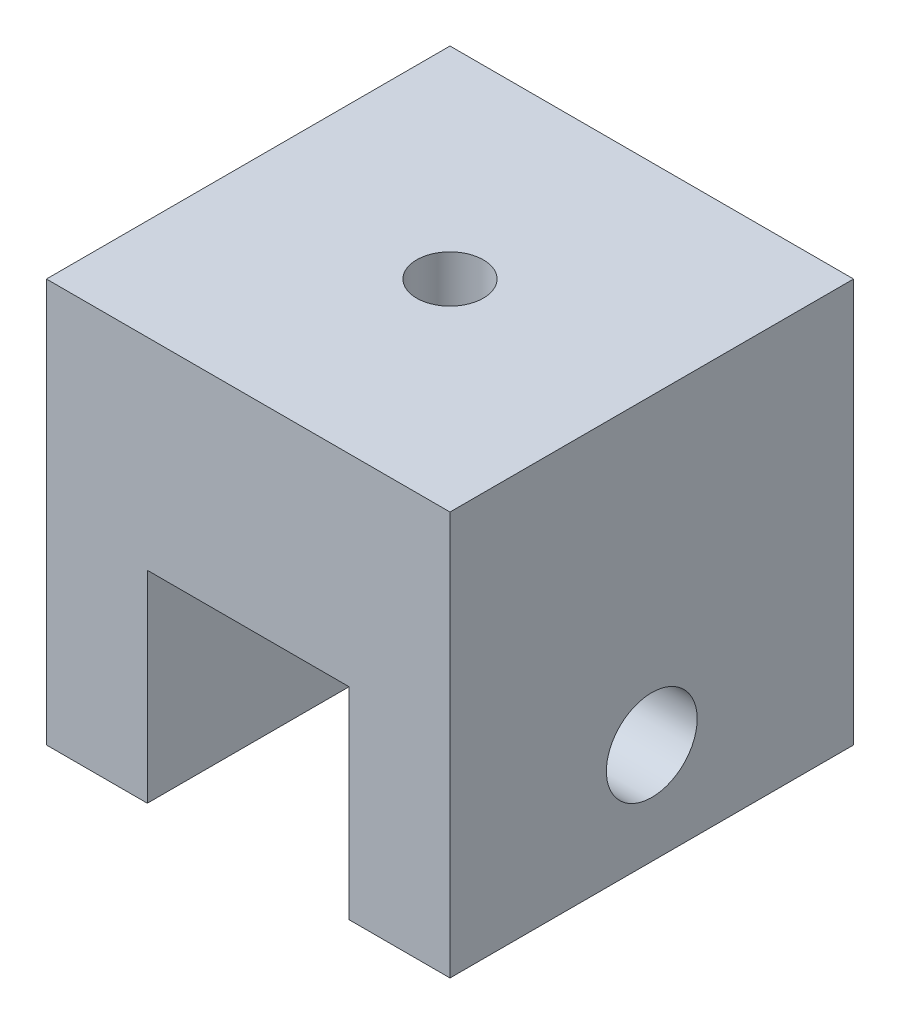
ISO-10303-21;
HEADER;
FILE_DESCRIPTION(('STEP AP214'),'2;1');
FILE_NAME('part.step','',(''),(''),'','','');
FILE_SCHEMA(('AUTOMOTIVE_DESIGN { 1 0 10303 214 1 1 1 1 }'));
ENDSEC;
DATA;
#1=APPLICATION_CONTEXT('core data for automotive mechanical design processes');
#2=APPLICATION_PROTOCOL_DEFINITION('international standard','automotive_design',2000,#1);
#3=PRODUCT_CONTEXT('',#1,'mechanical');
#4=PRODUCT('Part','Part','',(#3));
#5=PRODUCT_RELATED_PRODUCT_CATEGORY('part','',(#4));
#6=PRODUCT_DEFINITION_FORMATION('','',#4);
#7=PRODUCT_DEFINITION_CONTEXT('part definition',#1,'design');
#8=PRODUCT_DEFINITION('design','',#6,#7);
#9=PRODUCT_DEFINITION_SHAPE('','',#8);
#10=(LENGTH_UNIT() NAMED_UNIT(*) SI_UNIT(.MILLI.,.METRE.));
#11=(NAMED_UNIT(*) PLANE_ANGLE_UNIT() SI_UNIT($,.RADIAN.));
#12=(NAMED_UNIT(*) SI_UNIT($,.STERADIAN.) SOLID_ANGLE_UNIT());
#13=UNCERTAINTY_MEASURE_WITH_UNIT(LENGTH_MEASURE(1.E-05),#10,'distance_accuracy_value','');
#14=(GEOMETRIC_REPRESENTATION_CONTEXT(3) GLOBAL_UNCERTAINTY_ASSIGNED_CONTEXT((#13)) GLOBAL_UNIT_ASSIGNED_CONTEXT((#10,
#11,#12)) REPRESENTATION_CONTEXT('',''));
#15=CARTESIAN_POINT('',(0.,0.,0.));
#16=DIRECTION('',(0.,0.,1.));
#17=DIRECTION('',(1.,0.,0.));
#18=AXIS2_PLACEMENT_3D('',#15,#16,#17);
#19=CARTESIAN_POINT('',(0.,0.,0.));
#20=DIRECTION('',(0.,-1.,0.));
#21=DIRECTION('',(0.,0.,-1.));
#22=AXIS2_PLACEMENT_3D('',#19,#20,#21);
#23=PLANE('',#22);
#24=DIRECTION('',(0.,0.,1.));
#25=VECTOR('',#24,1.);
#26=CARTESIAN_POINT('',(10.,0.,0.));
#27=LINE('',#26,#25);
#28=CARTESIAN_POINT('',(10.,0.,-20.));
#29=VERTEX_POINT('',#28);
#30=CARTESIAN_POINT('',(10.,0.,20.));
#31=VERTEX_POINT('',#30);
#32=EDGE_CURVE('E11',#29,#31,#27,.T.);
#33=ORIENTED_EDGE('',*,*,#32,.F.);
#34=DIRECTION('',(-1.,0.,0.));
#35=VECTOR('',#34,1.);
#36=CARTESIAN_POINT('',(-20.,0.,-20.));
#37=LINE('',#36,#35);
#38=CARTESIAN_POINT('',(20.,0.,-20.));
#39=VERTEX_POINT('',#38);
#40=EDGE_CURVE('E138',#39,#29,#37,.T.);
#41=ORIENTED_EDGE('',*,*,#40,.F.);
#42=DIRECTION('',(0.,0.,-1.));
#43=VECTOR('',#42,1.);
#44=CARTESIAN_POINT('',(20.,0.,20.));
#45=LINE('',#44,#43);
#46=CARTESIAN_POINT('',(20.,0.,20.));
#47=VERTEX_POINT('',#46);
#48=EDGE_CURVE('E161',#47,#39,#45,.T.);
#49=ORIENTED_EDGE('',*,*,#48,.F.);
#50=DIRECTION('',(1.,0.,0.));
#51=VECTOR('',#50,1.);
#52=CARTESIAN_POINT('',(-20.,0.,20.));
#53=LINE('',#52,#51);
#54=EDGE_CURVE('E86',#31,#47,#53,.T.);
#55=ORIENTED_EDGE('',*,*,#54,.F.);
#56=EDGE_LOOP('',(#33,#41,#49,#55));
#57=FACE_BOUND('',#56,.T.);
#58=ADVANCED_FACE('F39',(#57),#23,.T.);
#59=CARTESIAN_POINT('',(20.,40.,20.));
#60=DIRECTION('',(-1.,0.,0.));
#61=DIRECTION('',(0.,0.,1.));
#62=AXIS2_PLACEMENT_3D('',#59,#60,#61);
#63=PLANE('',#62);
#64=CARTESIAN_POINT('',(20.,10.,0.));
#65=DIRECTION('',(1.,0.,0.));
#66=DIRECTION('',(0.,0.,-1.));
#67=AXIS2_PLACEMENT_3D('',#64,#65,#66);
#68=CIRCLE('',#67,4.5);
#69=CARTESIAN_POINT('',(20.,10.,-4.5));
#70=VERTEX_POINT('',#69);
#71=EDGE_CURVE('E331',#70,#70,#68,.T.);
#72=ORIENTED_EDGE('',*,*,#71,.F.);
#73=EDGE_LOOP('',(#72));
#74=FACE_BOUND('',#73,.T.);
#75=ORIENTED_EDGE('',*,*,#48,.T.);
#76=DIRECTION('',(0.,-1.,0.));
#77=VECTOR('',#76,1.);
#78=CARTESIAN_POINT('',(20.,40.,-20.));
#79=LINE('',#78,#77);
#80=CARTESIAN_POINT('',(20.,40.,-20.));
#81=VERTEX_POINT('',#80);
#82=EDGE_CURVE('E196',#81,#39,#79,.T.);
#83=ORIENTED_EDGE('',*,*,#82,.F.);
#84=DIRECTION('',(0.,0.,-1.));
#85=VECTOR('',#84,1.);
#86=CARTESIAN_POINT('',(20.,40.,20.));
#87=LINE('',#86,#85);
#88=CARTESIAN_POINT('',(20.,40.,20.));
#89=VERTEX_POINT('',#88);
#90=EDGE_CURVE('E162',#89,#81,#87,.T.);
#91=ORIENTED_EDGE('',*,*,#90,.F.);
#92=DIRECTION('',(0.,-1.,0.));
#93=VECTOR('',#92,1.);
#94=CARTESIAN_POINT('',(20.,40.,20.));
#95=LINE('',#94,#93);
#96=EDGE_CURVE('E173',#89,#47,#95,.T.);
#97=ORIENTED_EDGE('',*,*,#96,.T.);
#98=EDGE_LOOP('',(#75,#83,#91,#97));
#99=FACE_BOUND('',#98,.T.);
#100=ADVANCED_FACE('F41',(#74,#99),#63,.F.);
#101=CARTESIAN_POINT('',(-20.,40.,-20.));
#102=DIRECTION('',(0.,0.,1.));
#103=DIRECTION('',(1.,0.,0.));
#104=AXIS2_PLACEMENT_3D('',#101,#102,#103);
#105=PLANE('',#104);
#106=ORIENTED_EDGE('',*,*,#40,.T.);
#107=DIRECTION('',(0.,1.,0.));
#108=VECTOR('',#107,1.);
#109=CARTESIAN_POINT('',(10.,-20.,-20.));
#110=LINE('',#109,#108);
#111=CARTESIAN_POINT('',(10.,20.,-20.));
#112=VERTEX_POINT('',#111);
#113=EDGE_CURVE('E118',#29,#112,#110,.T.);
#114=ORIENTED_EDGE('',*,*,#113,.T.);
#115=DIRECTION('',(-1.,0.,0.));
#116=VECTOR('',#115,1.);
#117=CARTESIAN_POINT('',(-10.,20.,-20.));
#118=LINE('',#117,#116);
#119=CARTESIAN_POINT('',(-10.,20.,-20.));
#120=VERTEX_POINT('',#119);
#121=EDGE_CURVE('E129',#112,#120,#118,.T.);
#122=ORIENTED_EDGE('',*,*,#121,.T.);
#123=DIRECTION('',(0.,-1.,0.));
#124=VECTOR('',#123,1.);
#125=CARTESIAN_POINT('',(-10.,-20.,-20.));
#126=LINE('',#125,#124);
#127=CARTESIAN_POINT('',(-10.,0.,-20.));
#128=VERTEX_POINT('',#127);
#129=EDGE_CURVE('E126',#120,#128,#126,.T.);
#130=ORIENTED_EDGE('',*,*,#129,.T.);
#131=CARTESIAN_POINT('',(-20.,0.,-20.));
#132=VERTEX_POINT('',#131);
#133=EDGE_CURVE('E177',#128,#132,#37,.T.);
#134=ORIENTED_EDGE('',*,*,#133,.T.);
#135=DIRECTION('',(0.,-1.,0.));
#136=VECTOR('',#135,1.);
#137=CARTESIAN_POINT('',(-20.,40.,-20.));
#138=LINE('',#137,#136);
#139=CARTESIAN_POINT('',(-20.,40.,-20.));
#140=VERTEX_POINT('',#139);
#141=EDGE_CURVE('E192',#140,#132,#138,.T.);
#142=ORIENTED_EDGE('',*,*,#141,.F.);
#143=DIRECTION('',(-1.,0.,0.));
#144=VECTOR('',#143,1.);
#145=CARTESIAN_POINT('',(-20.,40.,-20.));
#146=LINE('',#145,#144);
#147=EDGE_CURVE('E94',#81,#140,#146,.T.);
#148=ORIENTED_EDGE('',*,*,#147,.F.);
#149=ORIENTED_EDGE('',*,*,#82,.T.);
#150=EDGE_LOOP('',(#106,#114,#122,#130,#134,#142,#148,#149));
#151=FACE_BOUND('',#150,.T.);
#152=ADVANCED_FACE('F137',(#151),#105,.F.);
#153=CARTESIAN_POINT('',(-20.,40.,20.));
#154=DIRECTION('',(1.,0.,0.));
#155=DIRECTION('',(0.,0.,-1.));
#156=AXIS2_PLACEMENT_3D('',#153,#154,#155);
#157=PLANE('',#156);
#158=CARTESIAN_POINT('',(-20.,10.,0.));
#159=DIRECTION('',(1.,0.,0.));
#160=DIRECTION('',(0.,0.,-1.));
#161=AXIS2_PLACEMENT_3D('',#158,#159,#160);
#162=CIRCLE('',#161,4.5);
#163=CARTESIAN_POINT('',(-20.,10.,-4.5));
#164=VERTEX_POINT('',#163);
#165=EDGE_CURVE('E337',#164,#164,#162,.T.);
#166=ORIENTED_EDGE('',*,*,#165,.T.);
#167=EDGE_LOOP('',(#166));
#168=FACE_BOUND('',#167,.T.);
#169=DIRECTION('',(0.,0.,1.));
#170=VECTOR('',#169,1.);
#171=CARTESIAN_POINT('',(-20.,0.,20.));
#172=LINE('',#171,#170);
#173=CARTESIAN_POINT('',(-20.,0.,20.));
#174=VERTEX_POINT('',#173);
#175=EDGE_CURVE('E180',#132,#174,#172,.T.);
#176=ORIENTED_EDGE('',*,*,#175,.T.);
#177=DIRECTION('',(0.,-1.,0.));
#178=VECTOR('',#177,1.);
#179=CARTESIAN_POINT('',(-20.,40.,20.));
#180=LINE('',#179,#178);
#181=CARTESIAN_POINT('',(-20.,40.,20.));
#182=VERTEX_POINT('',#181);
#183=EDGE_CURVE('E188',#182,#174,#180,.T.);
#184=ORIENTED_EDGE('',*,*,#183,.F.);
#185=DIRECTION('',(0.,0.,1.));
#186=VECTOR('',#185,1.);
#187=CARTESIAN_POINT('',(-20.,40.,20.));
#188=LINE('',#187,#186);
#189=EDGE_CURVE('E168',#140,#182,#188,.T.);
#190=ORIENTED_EDGE('',*,*,#189,.F.);
#191=ORIENTED_EDGE('',*,*,#141,.T.);
#192=EDGE_LOOP('',(#176,#184,#190,#191));
#193=FACE_BOUND('',#192,.T.);
#194=ADVANCED_FACE('F213',(#168,#193),#157,.F.);
#195=CARTESIAN_POINT('',(-20.,40.,20.));
#196=DIRECTION('',(0.,0.,-1.));
#197=DIRECTION('',(-1.,0.,0.));
#198=AXIS2_PLACEMENT_3D('',#195,#196,#197);
#199=PLANE('',#198);
#200=DIRECTION('',(-1.,0.,0.));
#201=VECTOR('',#200,1.);
#202=CARTESIAN_POINT('',(-10.,20.,20.));
#203=LINE('',#202,#201);
#204=CARTESIAN_POINT('',(10.,20.,20.));
#205=VERTEX_POINT('',#204);
#206=CARTESIAN_POINT('',(-10.,20.,20.));
#207=VERTEX_POINT('',#206);
#208=EDGE_CURVE('E142',#205,#207,#203,.T.);
#209=ORIENTED_EDGE('',*,*,#208,.F.);
#210=DIRECTION('',(0.,1.,0.));
#211=VECTOR('',#210,1.);
#212=CARTESIAN_POINT('',(10.,-20.,20.));
#213=LINE('',#212,#211);
#214=EDGE_CURVE('E120',#31,#205,#213,.T.);
#215=ORIENTED_EDGE('',*,*,#214,.F.);
#216=ORIENTED_EDGE('',*,*,#54,.T.);
#217=ORIENTED_EDGE('',*,*,#96,.F.);
#218=DIRECTION('',(1.,0.,0.));
#219=VECTOR('',#218,1.);
#220=CARTESIAN_POINT('',(-20.,40.,20.));
#221=LINE('',#220,#219);
#222=EDGE_CURVE('E65',#182,#89,#221,.T.);
#223=ORIENTED_EDGE('',*,*,#222,.F.);
#224=ORIENTED_EDGE('',*,*,#183,.T.);
#225=CARTESIAN_POINT('',(-10.,0.,20.));
#226=VERTEX_POINT('',#225);
#227=EDGE_CURVE('E165',#174,#226,#53,.T.);
#228=ORIENTED_EDGE('',*,*,#227,.T.);
#229=DIRECTION('',(0.,-1.,0.));
#230=VECTOR('',#229,1.);
#231=CARTESIAN_POINT('',(-10.,-20.,20.));
#232=LINE('',#231,#230);
#233=EDGE_CURVE('E56',#207,#226,#232,.T.);
#234=ORIENTED_EDGE('',*,*,#233,.F.);
#235=EDGE_LOOP('',(#209,#215,#216,#217,#223,#224,#228,#234));
#236=FACE_BOUND('',#235,.T.);
#237=ADVANCED_FACE('F215',(#236),#199,.F.);
#238=CARTESIAN_POINT('',(0.,40.,0.));
#239=DIRECTION('',(0.,-1.,0.));
#240=DIRECTION('',(0.,0.,-1.));
#241=AXIS2_PLACEMENT_3D('',#238,#239,#240);
#242=PLANE('',#241);
#243=CARTESIAN_POINT('',(0.,40.,0.));
#244=DIRECTION('',(0.,1.,0.));
#245=DIRECTION('',(0.,0.,1.));
#246=AXIS2_PLACEMENT_3D('',#243,#244,#245);
#247=CIRCLE('',#246,3.3);
#248=CARTESIAN_POINT('',(0.,40.,3.3));
#249=VERTEX_POINT('',#248);
#250=EDGE_CURVE('E157',#249,#249,#247,.T.);
#251=ORIENTED_EDGE('',*,*,#250,.F.);
#252=EDGE_LOOP('',(#251));
#253=FACE_BOUND('',#252,.T.);
#254=ORIENTED_EDGE('',*,*,#90,.T.);
#255=ORIENTED_EDGE('',*,*,#147,.T.);
#256=ORIENTED_EDGE('',*,*,#189,.T.);
#257=ORIENTED_EDGE('',*,*,#222,.T.);
#258=EDGE_LOOP('',(#254,#255,#256,#257));
#259=FACE_BOUND('',#258,.T.);
#260=ADVANCED_FACE('F220',(#253,#259),#242,.F.);
#261=DIRECTION('',(0.,0.,-1.));
#262=VECTOR('',#261,1.);
#263=CARTESIAN_POINT('',(-10.,0.,0.));
#264=LINE('',#263,#262);
#265=EDGE_CURVE('E49',#226,#128,#264,.T.);
#266=ORIENTED_EDGE('',*,*,#265,.F.);
#267=ORIENTED_EDGE('',*,*,#227,.F.);
#268=ORIENTED_EDGE('',*,*,#175,.F.);
#269=ORIENTED_EDGE('',*,*,#133,.F.);
#270=EDGE_LOOP('',(#266,#267,#268,#269));
#271=FACE_BOUND('',#270,.T.);
#272=ADVANCED_FACE('F208',(#271),#23,.T.);
#273=CARTESIAN_POINT('',(0.,0.,0.));
#274=DIRECTION('',(0.,1.,0.));
#275=DIRECTION('',(0.,0.,1.));
#276=AXIS2_PLACEMENT_3D('',#273,#274,#275);
#277=CYLINDRICAL_SURFACE('',#276,3.3);
#278=CARTESIAN_POINT('',(0.,20.,0.));
#279=DIRECTION('',(0.,1.,0.));
#280=DIRECTION('',(0.,0.,1.));
#281=AXIS2_PLACEMENT_3D('',#278,#279,#280);
#282=CIRCLE('',#281,3.3);
#283=CARTESIAN_POINT('',(0.,20.,3.3));
#284=VERTEX_POINT('',#283);
#285=EDGE_CURVE('E155',#284,#284,#282,.F.);
#286=ORIENTED_EDGE('',*,*,#285,.T.);
#287=EDGE_LOOP('',(#286));
#288=FACE_BOUND('',#287,.T.);
#289=ORIENTED_EDGE('',*,*,#250,.T.);
#290=EDGE_LOOP('',(#289));
#291=FACE_BOUND('',#290,.T.);
#292=ADVANCED_FACE('F228',(#288,#291),#277,.F.);
#293=CARTESIAN_POINT('',(-10.,20.,-20.));
#294=DIRECTION('',(0.,1.,0.));
#295=DIRECTION('',(0.,0.,1.));
#296=AXIS2_PLACEMENT_3D('',#293,#294,#295);
#297=PLANE('',#296);
#298=ORIENTED_EDGE('',*,*,#208,.T.);
#299=DIRECTION('',(0.,0.,1.));
#300=VECTOR('',#299,1.);
#301=CARTESIAN_POINT('',(-10.,20.,-20.));
#302=LINE('',#301,#300);
#303=EDGE_CURVE('E125',#120,#207,#302,.T.);
#304=ORIENTED_EDGE('',*,*,#303,.F.);
#305=ORIENTED_EDGE('',*,*,#121,.F.);
#306=DIRECTION('',(0.,0.,1.));
#307=VECTOR('',#306,1.);
#308=CARTESIAN_POINT('',(10.,20.,-20.));
#309=LINE('',#308,#307);
#310=EDGE_CURVE('E114',#112,#205,#309,.T.);
#311=ORIENTED_EDGE('',*,*,#310,.T.);
#312=EDGE_LOOP('',(#298,#304,#305,#311));
#313=FACE_BOUND('',#312,.T.);
#314=ORIENTED_EDGE('',*,*,#285,.F.);
#315=EDGE_LOOP('',(#314));
#316=FACE_BOUND('',#315,.T.);
#317=ADVANCED_FACE('F130',(#313,#316),#297,.F.);
#318=CARTESIAN_POINT('',(10.,-20.,-20.));
#319=DIRECTION('',(1.,0.,0.));
#320=DIRECTION('',(0.,0.,-1.));
#321=AXIS2_PLACEMENT_3D('',#318,#319,#320);
#322=PLANE('',#321);
#323=CARTESIAN_POINT('',(10.,10.,0.));
#324=DIRECTION('',(1.,0.,0.));
#325=DIRECTION('',(0.,0.,-1.));
#326=AXIS2_PLACEMENT_3D('',#323,#324,#325);
#327=CIRCLE('',#326,4.5);
#328=CARTESIAN_POINT('',(10.,10.,-4.5));
#329=VERTEX_POINT('',#328);
#330=EDGE_CURVE('E145',#329,#329,#327,.T.);
#331=ORIENTED_EDGE('',*,*,#330,.T.);
#332=EDGE_LOOP('',(#331));
#333=FACE_BOUND('',#332,.T.);
#334=ORIENTED_EDGE('',*,*,#32,.T.);
#335=ORIENTED_EDGE('',*,*,#214,.T.);
#336=ORIENTED_EDGE('',*,*,#310,.F.);
#337=ORIENTED_EDGE('',*,*,#113,.F.);
#338=EDGE_LOOP('',(#334,#335,#336,#337));
#339=FACE_BOUND('',#338,.T.);
#340=ADVANCED_FACE('F116',(#333,#339),#322,.F.);
#341=CARTESIAN_POINT('',(-10.,-20.,-20.));
#342=DIRECTION('',(-1.,0.,0.));
#343=DIRECTION('',(0.,0.,1.));
#344=AXIS2_PLACEMENT_3D('',#341,#342,#343);
#345=PLANE('',#344);
#346=CARTESIAN_POINT('',(-10.,10.,0.));
#347=DIRECTION('',(-1.,0.,0.));
#348=DIRECTION('',(0.,0.,1.));
#349=AXIS2_PLACEMENT_3D('',#346,#347,#348);
#350=CIRCLE('',#349,4.5);
#351=CARTESIAN_POINT('',(-10.,10.,4.5));
#352=VERTEX_POINT('',#351);
#353=EDGE_CURVE('E43',#352,#352,#350,.T.);
#354=ORIENTED_EDGE('',*,*,#353,.T.);
#355=EDGE_LOOP('',(#354));
#356=FACE_BOUND('',#355,.T.);
#357=ORIENTED_EDGE('',*,*,#265,.T.);
#358=ORIENTED_EDGE('',*,*,#129,.F.);
#359=ORIENTED_EDGE('',*,*,#303,.T.);
#360=ORIENTED_EDGE('',*,*,#233,.T.);
#361=EDGE_LOOP('',(#357,#358,#359,#360));
#362=FACE_BOUND('',#361,.T.);
#363=ADVANCED_FACE('F203',(#356,#362),#345,.F.);
#364=CARTESIAN_POINT('',(-20.,10.,0.));
#365=DIRECTION('',(1.,0.,0.));
#366=DIRECTION('',(0.,0.,-1.));
#367=AXIS2_PLACEMENT_3D('',#364,#365,#366);
#368=CYLINDRICAL_SURFACE('',#367,4.5);
#369=ORIENTED_EDGE('',*,*,#165,.F.);
#370=EDGE_LOOP('',(#369));
#371=FACE_BOUND('',#370,.T.);
#372=ORIENTED_EDGE('',*,*,#353,.F.);
#373=EDGE_LOOP('',(#372));
#374=FACE_BOUND('',#373,.T.);
#375=ADVANCED_FACE('F302',(#371,#374),#368,.F.);
#376=ORIENTED_EDGE('',*,*,#71,.T.);
#377=EDGE_LOOP('',(#376));
#378=FACE_BOUND('',#377,.T.);
#379=ORIENTED_EDGE('',*,*,#330,.F.);
#380=EDGE_LOOP('',(#379));
#381=FACE_BOUND('',#380,.T.);
#382=ADVANCED_FACE('F310',(#378,#381),#368,.F.);
#383=CLOSED_SHELL('',(#58,#100,#152,#194,#237,#260,#272,#292,#317,#340,#363,#375,#382));
#384=MANIFOLD_SOLID_BREP('B2',#383);
#385=ADVANCED_BREP_SHAPE_REPRESENTATION('',(#18,#384),#14);
#386=SHAPE_DEFINITION_REPRESENTATION(#9,#385);
ENDSEC;
END-ISO-10303-21;
